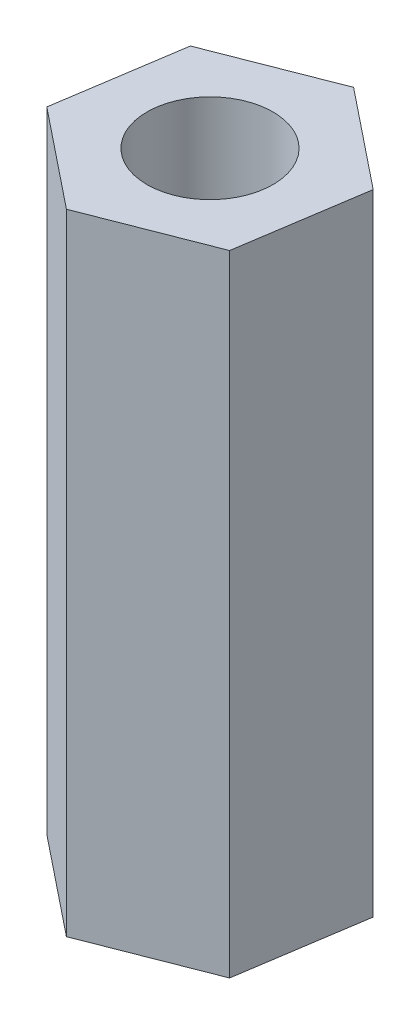
ISO-10303-21;
HEADER;
FILE_DESCRIPTION(('STEP AP214'),'2;1');
FILE_NAME('part.step','',(''),(''),'','','');
FILE_SCHEMA(('AUTOMOTIVE_DESIGN { 1 0 10303 214 1 1 1 1 }'));
ENDSEC;
DATA;
#1=APPLICATION_CONTEXT('core data for automotive mechanical design processes');
#2=APPLICATION_PROTOCOL_DEFINITION('international standard','automotive_design',2000,#1);
#3=PRODUCT_CONTEXT('',#1,'mechanical');
#4=PRODUCT('Part','Part','',(#3));
#5=PRODUCT_RELATED_PRODUCT_CATEGORY('part','',(#4));
#6=PRODUCT_DEFINITION_FORMATION('','',#4);
#7=PRODUCT_DEFINITION_CONTEXT('part definition',#1,'design');
#8=PRODUCT_DEFINITION('design','',#6,#7);
#9=PRODUCT_DEFINITION_SHAPE('','',#8);
#10=(LENGTH_UNIT() NAMED_UNIT(*) SI_UNIT(.MILLI.,.METRE.));
#11=(NAMED_UNIT(*) PLANE_ANGLE_UNIT() SI_UNIT($,.RADIAN.));
#12=(NAMED_UNIT(*) SI_UNIT($,.STERADIAN.) SOLID_ANGLE_UNIT());
#13=UNCERTAINTY_MEASURE_WITH_UNIT(LENGTH_MEASURE(1.E-05),#10,'distance_accuracy_value','');
#14=(GEOMETRIC_REPRESENTATION_CONTEXT(3) GLOBAL_UNCERTAINTY_ASSIGNED_CONTEXT((#13)) GLOBAL_UNIT_ASSIGNED_CONTEXT((#10,
#11,#12)) REPRESENTATION_CONTEXT('',''));
#15=CARTESIAN_POINT('',(0.,0.,0.));
#16=DIRECTION('',(0.,0.,1.));
#17=DIRECTION('',(1.,0.,0.));
#18=AXIS2_PLACEMENT_3D('',#15,#16,#17);
#19=CARTESIAN_POINT('',(2.3418742493994,-15.,1.875));
#20=DIRECTION('',(0.988540864149498,0.,0.150953502465374));
#21=DIRECTION('',(0.150953502465374,0.,-0.988540864149498));
#22=AXIS2_PLACEMENT_3D('',#19,#20,#21);
#23=PLANE('',#22);
#24=DIRECTION('',(0.150953502465374,0.,-0.988540864149498));
#25=VECTOR('',#24,1.);
#26=CARTESIAN_POINT('',(2.3418742493994,0.,1.875));
#27=LINE('',#26,#25);
#28=CARTESIAN_POINT('',(2.3418742493994,0.,1.875));
#29=VERTEX_POINT('',#28);
#30=CARTESIAN_POINT('',(2.79473475679552,0.,-1.0906225924485));
#31=VERTEX_POINT('',#30);
#32=EDGE_CURVE('E118',#29,#31,#27,.T.);
#33=ORIENTED_EDGE('',*,*,#32,.F.);
#34=DIRECTION('',(0.,1.,0.));
#35=VECTOR('',#34,1.);
#36=CARTESIAN_POINT('',(2.3418742493994,-15.,1.875));
#37=LINE('',#36,#35);
#38=CARTESIAN_POINT('',(2.3418742493994,-15.,1.875));
#39=VERTEX_POINT('',#38);
#40=EDGE_CURVE('E11',#39,#29,#37,.T.);
#41=ORIENTED_EDGE('',*,*,#40,.F.);
#42=DIRECTION('',(0.150953502465374,0.,-0.988540864149498));
#43=VECTOR('',#42,1.);
#44=CARTESIAN_POINT('',(2.3418742493994,-15.,1.875));
#45=LINE('',#44,#43);
#46=CARTESIAN_POINT('',(2.79473475679552,-15.,-1.0906225924485));
#47=VERTEX_POINT('',#46);
#48=EDGE_CURVE('E133',#39,#47,#45,.T.);
#49=ORIENTED_EDGE('',*,*,#48,.T.);
#50=DIRECTION('',(0.,1.,0.));
#51=VECTOR('',#50,1.);
#52=CARTESIAN_POINT('',(2.79473475679552,-15.,-1.0906225924485));
#53=LINE('',#52,#51);
#54=EDGE_CURVE('E36',#47,#31,#53,.T.);
#55=ORIENTED_EDGE('',*,*,#54,.T.);
#56=EDGE_LOOP('',(#33,#41,#49,#55));
#57=FACE_BOUND('',#56,.T.);
#58=ADVANCED_FACE('F33',(#57),#23,.T.);
#59=CARTESIAN_POINT('',(-0.45286050739612,-15.,2.96562259244849));
#60=DIRECTION('',(0.363540864149498,0.,0.931578252265174));
#61=DIRECTION('',(0.931578252265174,0.,-0.363540864149498));
#62=AXIS2_PLACEMENT_3D('',#59,#60,#61);
#63=PLANE('',#62);
#64=DIRECTION('',(0.931578252265174,0.,-0.363540864149498));
#65=VECTOR('',#64,1.);
#66=CARTESIAN_POINT('',(-0.45286050739612,0.,2.96562259244849));
#67=LINE('',#66,#65);
#68=CARTESIAN_POINT('',(-0.45286050739612,0.,2.96562259244849));
#69=VERTEX_POINT('',#68);
#70=EDGE_CURVE('E131',#69,#29,#67,.T.);
#71=ORIENTED_EDGE('',*,*,#70,.F.);
#72=DIRECTION('',(0.,1.,0.));
#73=VECTOR('',#72,1.);
#74=CARTESIAN_POINT('',(-0.45286050739612,-15.,2.96562259244849));
#75=LINE('',#74,#73);
#76=CARTESIAN_POINT('',(-0.45286050739612,-15.,2.96562259244849));
#77=VERTEX_POINT('',#76);
#78=EDGE_CURVE('E42',#77,#69,#75,.T.);
#79=ORIENTED_EDGE('',*,*,#78,.F.);
#80=DIRECTION('',(0.931578252265174,0.,-0.363540864149498));
#81=VECTOR('',#80,1.);
#82=CARTESIAN_POINT('',(-0.45286050739612,-15.,2.96562259244849));
#83=LINE('',#82,#81);
#84=EDGE_CURVE('E108',#77,#39,#83,.T.);
#85=ORIENTED_EDGE('',*,*,#84,.T.);
#86=ORIENTED_EDGE('',*,*,#40,.T.);
#87=EDGE_LOOP('',(#71,#79,#85,#86));
#88=FACE_BOUND('',#87,.T.);
#89=ADVANCED_FACE('F141',(#88),#63,.T.);
#90=CARTESIAN_POINT('',(-2.79473475679552,-15.,1.09062259244849));
#91=DIRECTION('',(-0.625,0.,0.7806247497998));
#92=DIRECTION('',(0.7806247497998,0.,0.625));
#93=AXIS2_PLACEMENT_3D('',#90,#91,#92);
#94=PLANE('',#93);
#95=DIRECTION('',(0.7806247497998,0.,0.625));
#96=VECTOR('',#95,1.);
#97=CARTESIAN_POINT('',(-2.79473475679552,0.,1.09062259244849));
#98=LINE('',#97,#96);
#99=CARTESIAN_POINT('',(-2.79473475679552,0.,1.09062259244849));
#100=VERTEX_POINT('',#99);
#101=EDGE_CURVE('E95',#100,#69,#98,.T.);
#102=ORIENTED_EDGE('',*,*,#101,.F.);
#103=DIRECTION('',(0.,1.,0.));
#104=VECTOR('',#103,1.);
#105=CARTESIAN_POINT('',(-2.79473475679552,-15.,1.09062259244849));
#106=LINE('',#105,#104);
#107=CARTESIAN_POINT('',(-2.79473475679552,-15.,1.09062259244849));
#108=VERTEX_POINT('',#107);
#109=EDGE_CURVE('E90',#108,#100,#106,.T.);
#110=ORIENTED_EDGE('',*,*,#109,.F.);
#111=DIRECTION('',(0.7806247497998,0.,0.625));
#112=VECTOR('',#111,1.);
#113=CARTESIAN_POINT('',(-2.79473475679552,-15.,1.09062259244849));
#114=LINE('',#113,#112);
#115=EDGE_CURVE('E93',#108,#77,#114,.T.);
#116=ORIENTED_EDGE('',*,*,#115,.T.);
#117=ORIENTED_EDGE('',*,*,#78,.T.);
#118=EDGE_LOOP('',(#102,#110,#116,#117));
#119=FACE_BOUND('',#118,.T.);
#120=ADVANCED_FACE('F92',(#119),#94,.T.);
#121=CARTESIAN_POINT('',(-2.3418742493994,-15.,-1.875));
#122=DIRECTION('',(-0.988540864149498,0.,-0.150953502465374));
#123=DIRECTION('',(-0.150953502465374,0.,0.988540864149498));
#124=AXIS2_PLACEMENT_3D('',#121,#122,#123);
#125=PLANE('',#124);
#126=DIRECTION('',(-0.150953502465374,0.,0.988540864149498));
#127=VECTOR('',#126,1.);
#128=CARTESIAN_POINT('',(-2.3418742493994,0.,-1.875));
#129=LINE('',#128,#127);
#130=CARTESIAN_POINT('',(-2.3418742493994,0.,-1.875));
#131=VERTEX_POINT('',#130);
#132=EDGE_CURVE('E128',#131,#100,#129,.T.);
#133=ORIENTED_EDGE('',*,*,#132,.F.);
#134=DIRECTION('',(0.,1.,0.));
#135=VECTOR('',#134,1.);
#136=CARTESIAN_POINT('',(-2.3418742493994,-15.,-1.875));
#137=LINE('',#136,#135);
#138=CARTESIAN_POINT('',(-2.3418742493994,-15.,-1.875));
#139=VERTEX_POINT('',#138);
#140=EDGE_CURVE('E100',#139,#131,#137,.T.);
#141=ORIENTED_EDGE('',*,*,#140,.F.);
#142=DIRECTION('',(-0.150953502465374,0.,0.988540864149498));
#143=VECTOR('',#142,1.);
#144=CARTESIAN_POINT('',(-2.3418742493994,-15.,-1.875));
#145=LINE('',#144,#143);
#146=EDGE_CURVE('E106',#139,#108,#145,.T.);
#147=ORIENTED_EDGE('',*,*,#146,.T.);
#148=ORIENTED_EDGE('',*,*,#109,.T.);
#149=EDGE_LOOP('',(#133,#141,#147,#148));
#150=FACE_BOUND('',#149,.T.);
#151=ADVANCED_FACE('F110',(#150),#125,.T.);
#152=CARTESIAN_POINT('',(0.452860507396123,-15.,-2.96562259244849));
#153=DIRECTION('',(-0.363540864149498,0.,-0.931578252265174));
#154=DIRECTION('',(-0.931578252265174,0.,0.363540864149498));
#155=AXIS2_PLACEMENT_3D('',#152,#153,#154);
#156=PLANE('',#155);
#157=DIRECTION('',(-0.931578252265174,0.,0.363540864149498));
#158=VECTOR('',#157,1.);
#159=CARTESIAN_POINT('',(0.452860507396123,0.,-2.96562259244849));
#160=LINE('',#159,#158);
#161=CARTESIAN_POINT('',(0.452860507396123,0.,-2.96562259244849));
#162=VERTEX_POINT('',#161);
#163=EDGE_CURVE('E125',#162,#131,#160,.T.);
#164=ORIENTED_EDGE('',*,*,#163,.F.);
#165=DIRECTION('',(0.,1.,0.));
#166=VECTOR('',#165,1.);
#167=CARTESIAN_POINT('',(0.452860507396123,-15.,-2.96562259244849));
#168=LINE('',#167,#166);
#169=CARTESIAN_POINT('',(0.452860507396123,-15.,-2.96562259244849));
#170=VERTEX_POINT('',#169);
#171=EDGE_CURVE('E136',#170,#162,#168,.T.);
#172=ORIENTED_EDGE('',*,*,#171,.F.);
#173=DIRECTION('',(-0.931578252265174,0.,0.363540864149498));
#174=VECTOR('',#173,1.);
#175=CARTESIAN_POINT('',(0.452860507396123,-15.,-2.96562259244849));
#176=LINE('',#175,#174);
#177=EDGE_CURVE('E111',#170,#139,#176,.T.);
#178=ORIENTED_EDGE('',*,*,#177,.T.);
#179=ORIENTED_EDGE('',*,*,#140,.T.);
#180=EDGE_LOOP('',(#164,#172,#178,#179));
#181=FACE_BOUND('',#180,.T.);
#182=ADVANCED_FACE('F154',(#181),#156,.T.);
#183=CARTESIAN_POINT('',(2.79473475679552,-15.,-1.0906225924485));
#184=DIRECTION('',(0.625,0.,-0.7806247497998));
#185=DIRECTION('',(-0.7806247497998,0.,-0.625));
#186=AXIS2_PLACEMENT_3D('',#183,#184,#185);
#187=PLANE('',#186);
#188=DIRECTION('',(-0.7806247497998,0.,-0.625));
#189=VECTOR('',#188,1.);
#190=CARTESIAN_POINT('',(2.79473475679552,0.,-1.0906225924485));
#191=LINE('',#190,#189);
#192=EDGE_CURVE('E121',#31,#162,#191,.T.);
#193=ORIENTED_EDGE('',*,*,#192,.F.);
#194=ORIENTED_EDGE('',*,*,#54,.F.);
#195=DIRECTION('',(-0.7806247497998,0.,-0.625));
#196=VECTOR('',#195,1.);
#197=CARTESIAN_POINT('',(2.79473475679552,-15.,-1.0906225924485));
#198=LINE('',#197,#196);
#199=EDGE_CURVE('E113',#47,#170,#198,.T.);
#200=ORIENTED_EDGE('',*,*,#199,.T.);
#201=ORIENTED_EDGE('',*,*,#171,.T.);
#202=EDGE_LOOP('',(#193,#194,#200,#201));
#203=FACE_BOUND('',#202,.T.);
#204=ADVANCED_FACE('F138',(#203),#187,.T.);
#205=CARTESIAN_POINT('',(0.,-15.,0.));
#206=DIRECTION('',(0.,1.,0.));
#207=DIRECTION('',(0.,0.,1.));
#208=AXIS2_PLACEMENT_3D('',#205,#206,#207);
#209=PLANE('',#208);
#210=CARTESIAN_POINT('',(0.,-15.,0.));
#211=DIRECTION('',(0.,1.,0.));
#212=DIRECTION('',(0.,0.,1.));
#213=AXIS2_PLACEMENT_3D('',#210,#211,#212);
#214=CIRCLE('',#213,1.5);
#215=CARTESIAN_POINT('',(0.,-15.,1.5));
#216=VERTEX_POINT('',#215);
#217=EDGE_CURVE('E122',#216,#216,#214,.T.);
#218=ORIENTED_EDGE('',*,*,#217,.T.);
#219=EDGE_LOOP('',(#218));
#220=FACE_BOUND('',#219,.T.);
#221=ORIENTED_EDGE('',*,*,#48,.F.);
#222=ORIENTED_EDGE('',*,*,#84,.F.);
#223=ORIENTED_EDGE('',*,*,#115,.F.);
#224=ORIENTED_EDGE('',*,*,#146,.F.);
#225=ORIENTED_EDGE('',*,*,#177,.F.);
#226=ORIENTED_EDGE('',*,*,#199,.F.);
#227=EDGE_LOOP('',(#221,#222,#223,#224,#225,#226));
#228=FACE_BOUND('',#227,.T.);
#229=ADVANCED_FACE('F104',(#220,#228),#209,.F.);
#230=CARTESIAN_POINT('',(0.,0.,0.));
#231=DIRECTION('',(0.,1.,0.));
#232=DIRECTION('',(0.,0.,1.));
#233=AXIS2_PLACEMENT_3D('',#230,#231,#232);
#234=PLANE('',#233);
#235=CARTESIAN_POINT('',(0.,0.,0.));
#236=DIRECTION('',(0.,1.,0.));
#237=DIRECTION('',(0.,0.,1.));
#238=AXIS2_PLACEMENT_3D('',#235,#236,#237);
#239=CIRCLE('',#238,1.5);
#240=CARTESIAN_POINT('',(0.,0.,1.5));
#241=VERTEX_POINT('',#240);
#242=EDGE_CURVE('E177',#241,#241,#239,.T.);
#243=ORIENTED_EDGE('',*,*,#242,.F.);
#244=EDGE_LOOP('',(#243));
#245=FACE_BOUND('',#244,.T.);
#246=ORIENTED_EDGE('',*,*,#32,.T.);
#247=ORIENTED_EDGE('',*,*,#192,.T.);
#248=ORIENTED_EDGE('',*,*,#163,.T.);
#249=ORIENTED_EDGE('',*,*,#132,.T.);
#250=ORIENTED_EDGE('',*,*,#101,.T.);
#251=ORIENTED_EDGE('',*,*,#70,.T.);
#252=EDGE_LOOP('',(#246,#247,#248,#249,#250,#251));
#253=FACE_BOUND('',#252,.T.);
#254=ADVANCED_FACE('F140',(#245,#253),#234,.T.);
#255=CARTESIAN_POINT('',(0.,-15.,0.));
#256=DIRECTION('',(0.,1.,0.));
#257=DIRECTION('',(0.,0.,1.));
#258=AXIS2_PLACEMENT_3D('',#255,#256,#257);
#259=CYLINDRICAL_SURFACE('',#258,1.5);
#260=ORIENTED_EDGE('',*,*,#217,.F.);
#261=EDGE_LOOP('',(#260));
#262=FACE_BOUND('',#261,.T.);
#263=ORIENTED_EDGE('',*,*,#242,.T.);
#264=EDGE_LOOP('',(#263));
#265=FACE_BOUND('',#264,.T.);
#266=ADVANCED_FACE('F165',(#262,#265),#259,.F.);
#267=CLOSED_SHELL('',(#58,#89,#120,#151,#182,#204,#229,#254,#266));
#268=MANIFOLD_SOLID_BREP('B2',#267);
#269=ADVANCED_BREP_SHAPE_REPRESENTATION('',(#18,#268),#14);
#270=SHAPE_DEFINITION_REPRESENTATION(#9,#269);
ENDSEC;
END-ISO-10303-21;
